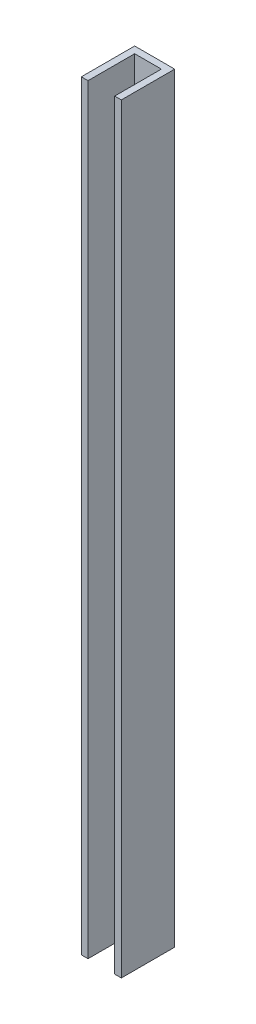
ISO-10303-21;
HEADER;
FILE_DESCRIPTION(('STEP AP214'),'2;1');
FILE_NAME('part.step','',(''),(''),'','','');
FILE_SCHEMA(('AUTOMOTIVE_DESIGN { 1 0 10303 214 1 1 1 1 }'));
ENDSEC;
DATA;
#1=APPLICATION_CONTEXT('core data for automotive mechanical design processes');
#2=APPLICATION_PROTOCOL_DEFINITION('international standard','automotive_design',2000,#1);
#3=PRODUCT_CONTEXT('',#1,'mechanical');
#4=PRODUCT('Part','Part','',(#3));
#5=PRODUCT_RELATED_PRODUCT_CATEGORY('part','',(#4));
#6=PRODUCT_DEFINITION_FORMATION('','',#4);
#7=PRODUCT_DEFINITION_CONTEXT('part definition',#1,'design');
#8=PRODUCT_DEFINITION('design','',#6,#7);
#9=PRODUCT_DEFINITION_SHAPE('','',#8);
#10=(LENGTH_UNIT() NAMED_UNIT(*) SI_UNIT(.MILLI.,.METRE.));
#11=(NAMED_UNIT(*) PLANE_ANGLE_UNIT() SI_UNIT($,.RADIAN.));
#12=(NAMED_UNIT(*) SI_UNIT($,.STERADIAN.) SOLID_ANGLE_UNIT());
#13=UNCERTAINTY_MEASURE_WITH_UNIT(LENGTH_MEASURE(1.E-05),#10,'distance_accuracy_value','');
#14=(GEOMETRIC_REPRESENTATION_CONTEXT(3) GLOBAL_UNCERTAINTY_ASSIGNED_CONTEXT((#13)) GLOBAL_UNIT_ASSIGNED_CONTEXT((#10,
#11,#12)) REPRESENTATION_CONTEXT('',''));
#15=CARTESIAN_POINT('',(0.,0.,0.));
#16=DIRECTION('',(0.,0.,1.));
#17=DIRECTION('',(1.,0.,0.));
#18=AXIS2_PLACEMENT_3D('',#15,#16,#17);
#19=CARTESIAN_POINT('',(3.175,361.95,0.));
#20=DIRECTION('',(0.,0.,-1.));
#21=DIRECTION('',(-1.,0.,0.));
#22=AXIS2_PLACEMENT_3D('',#19,#20,#21);
#23=PLANE('',#22);
#24=DIRECTION('',(1.,0.,0.));
#25=VECTOR('',#24,1.);
#26=CARTESIAN_POINT('',(3.175,0.,0.));
#27=LINE('',#26,#25);
#28=CARTESIAN_POINT('',(0.,0.,0.));
#29=VERTEX_POINT('',#28);
#30=CARTESIAN_POINT('',(3.175,0.,0.));
#31=VERTEX_POINT('',#30);
#32=EDGE_CURVE('E129',#29,#31,#27,.T.);
#33=ORIENTED_EDGE('',*,*,#32,.T.);
#34=DIRECTION('',(0.,-1.,0.));
#35=VECTOR('',#34,1.);
#36=CARTESIAN_POINT('',(3.175,361.95,0.));
#37=LINE('',#36,#35);
#38=CARTESIAN_POINT('',(3.175,361.95,0.));
#39=VERTEX_POINT('',#38);
#40=EDGE_CURVE('E11',#39,#31,#37,.T.);
#41=ORIENTED_EDGE('',*,*,#40,.F.);
#42=DIRECTION('',(1.,0.,0.));
#43=VECTOR('',#42,1.);
#44=CARTESIAN_POINT('',(3.175,361.95,0.));
#45=LINE('',#44,#43);
#46=CARTESIAN_POINT('',(0.,361.95,0.));
#47=VERTEX_POINT('',#46);
#48=EDGE_CURVE('E143',#47,#39,#45,.T.);
#49=ORIENTED_EDGE('',*,*,#48,.F.);
#50=DIRECTION('',(0.,-1.,0.));
#51=VECTOR('',#50,1.);
#52=CARTESIAN_POINT('',(0.,361.95,0.));
#53=LINE('',#52,#51);
#54=EDGE_CURVE('E125',#47,#29,#53,.T.);
#55=ORIENTED_EDGE('',*,*,#54,.T.);
#56=EDGE_LOOP('',(#33,#41,#49,#55));
#57=FACE_BOUND('',#56,.T.);
#58=ADVANCED_FACE('F33',(#57),#23,.F.);
#59=CARTESIAN_POINT('',(3.175,361.95,-22.225));
#60=DIRECTION('',(-1.,0.,0.));
#61=DIRECTION('',(0.,0.,1.));
#62=AXIS2_PLACEMENT_3D('',#59,#60,#61);
#63=PLANE('',#62);
#64=DIRECTION('',(0.,0.,-1.));
#65=VECTOR('',#64,1.);
#66=CARTESIAN_POINT('',(3.175,0.,-22.225));
#67=LINE('',#66,#65);
#68=CARTESIAN_POINT('',(3.175,0.,-22.225));
#69=VERTEX_POINT('',#68);
#70=EDGE_CURVE('E132',#31,#69,#67,.T.);
#71=ORIENTED_EDGE('',*,*,#70,.T.);
#72=DIRECTION('',(0.,-1.,0.));
#73=VECTOR('',#72,1.);
#74=CARTESIAN_POINT('',(3.175,361.95,-22.225));
#75=LINE('',#74,#73);
#76=CARTESIAN_POINT('',(3.175,361.95,-22.225));
#77=VERTEX_POINT('',#76);
#78=EDGE_CURVE('E41',#77,#69,#75,.T.);
#79=ORIENTED_EDGE('',*,*,#78,.F.);
#80=DIRECTION('',(0.,0.,-1.));
#81=VECTOR('',#80,1.);
#82=CARTESIAN_POINT('',(3.175,361.95,-22.225));
#83=LINE('',#82,#81);
#84=EDGE_CURVE('E92',#39,#77,#83,.T.);
#85=ORIENTED_EDGE('',*,*,#84,.F.);
#86=ORIENTED_EDGE('',*,*,#40,.T.);
#87=EDGE_LOOP('',(#71,#79,#85,#86));
#88=FACE_BOUND('',#87,.T.);
#89=ADVANCED_FACE('F178',(#88),#63,.F.);
#90=CARTESIAN_POINT('',(15.875,361.95,-22.225));
#91=DIRECTION('',(0.,0.,-1.));
#92=DIRECTION('',(-1.,0.,0.));
#93=AXIS2_PLACEMENT_3D('',#90,#91,#92);
#94=PLANE('',#93);
#95=DIRECTION('',(1.,0.,0.));
#96=VECTOR('',#95,1.);
#97=CARTESIAN_POINT('',(15.875,0.,-22.225));
#98=LINE('',#97,#96);
#99=CARTESIAN_POINT('',(15.875,0.,-22.225));
#100=VERTEX_POINT('',#99);
#101=EDGE_CURVE('E134',#69,#100,#98,.T.);
#102=ORIENTED_EDGE('',*,*,#101,.T.);
#103=DIRECTION('',(0.,-1.,0.));
#104=VECTOR('',#103,1.);
#105=CARTESIAN_POINT('',(15.875,361.95,-22.225));
#106=LINE('',#105,#104);
#107=CARTESIAN_POINT('',(15.875,361.95,-22.225));
#108=VERTEX_POINT('',#107);
#109=EDGE_CURVE('E150',#108,#100,#106,.T.);
#110=ORIENTED_EDGE('',*,*,#109,.F.);
#111=DIRECTION('',(1.,0.,0.));
#112=VECTOR('',#111,1.);
#113=CARTESIAN_POINT('',(15.875,361.95,-22.225));
#114=LINE('',#113,#112);
#115=EDGE_CURVE('E158',#77,#108,#114,.T.);
#116=ORIENTED_EDGE('',*,*,#115,.F.);
#117=ORIENTED_EDGE('',*,*,#78,.T.);
#118=EDGE_LOOP('',(#102,#110,#116,#117));
#119=FACE_BOUND('',#118,.T.);
#120=ADVANCED_FACE('F156',(#119),#94,.F.);
#121=CARTESIAN_POINT('',(15.875,361.95,0.));
#122=DIRECTION('',(1.,0.,0.));
#123=DIRECTION('',(0.,0.,-1.));
#124=AXIS2_PLACEMENT_3D('',#121,#122,#123);
#125=PLANE('',#124);
#126=DIRECTION('',(0.,0.,1.));
#127=VECTOR('',#126,1.);
#128=CARTESIAN_POINT('',(15.875,0.,0.));
#129=LINE('',#128,#127);
#130=CARTESIAN_POINT('',(15.875,0.,0.));
#131=VERTEX_POINT('',#130);
#132=EDGE_CURVE('E136',#100,#131,#129,.T.);
#133=ORIENTED_EDGE('',*,*,#132,.T.);
#134=DIRECTION('',(0.,-1.,0.));
#135=VECTOR('',#134,1.);
#136=CARTESIAN_POINT('',(15.875,361.95,0.));
#137=LINE('',#136,#135);
#138=CARTESIAN_POINT('',(15.875,361.95,0.));
#139=VERTEX_POINT('',#138);
#140=EDGE_CURVE('E147',#139,#131,#137,.T.);
#141=ORIENTED_EDGE('',*,*,#140,.F.);
#142=DIRECTION('',(0.,0.,1.));
#143=VECTOR('',#142,1.);
#144=CARTESIAN_POINT('',(15.875,361.95,0.));
#145=LINE('',#144,#143);
#146=EDGE_CURVE('E170',#108,#139,#145,.T.);
#147=ORIENTED_EDGE('',*,*,#146,.F.);
#148=ORIENTED_EDGE('',*,*,#109,.T.);
#149=EDGE_LOOP('',(#133,#141,#147,#148));
#150=FACE_BOUND('',#149,.T.);
#151=ADVANCED_FACE('F166',(#150),#125,.F.);
#152=CARTESIAN_POINT('',(19.05,361.95,0.));
#153=DIRECTION('',(0.,0.,-1.));
#154=DIRECTION('',(-1.,0.,0.));
#155=AXIS2_PLACEMENT_3D('',#152,#153,#154);
#156=PLANE('',#155);
#157=DIRECTION('',(1.,0.,0.));
#158=VECTOR('',#157,1.);
#159=CARTESIAN_POINT('',(19.05,0.,0.));
#160=LINE('',#159,#158);
#161=CARTESIAN_POINT('',(19.05,0.,0.));
#162=VERTEX_POINT('',#161);
#163=EDGE_CURVE('E138',#131,#162,#160,.T.);
#164=ORIENTED_EDGE('',*,*,#163,.T.);
#165=DIRECTION('',(0.,-1.,0.));
#166=VECTOR('',#165,1.);
#167=CARTESIAN_POINT('',(19.05,361.95,0.));
#168=LINE('',#167,#166);
#169=CARTESIAN_POINT('',(19.05,361.95,0.));
#170=VERTEX_POINT('',#169);
#171=EDGE_CURVE('E120',#170,#162,#168,.T.);
#172=ORIENTED_EDGE('',*,*,#171,.F.);
#173=DIRECTION('',(1.,0.,0.));
#174=VECTOR('',#173,1.);
#175=CARTESIAN_POINT('',(19.05,361.95,0.));
#176=LINE('',#175,#174);
#177=EDGE_CURVE('E111',#139,#170,#176,.T.);
#178=ORIENTED_EDGE('',*,*,#177,.F.);
#179=ORIENTED_EDGE('',*,*,#140,.T.);
#180=EDGE_LOOP('',(#164,#172,#178,#179));
#181=FACE_BOUND('',#180,.T.);
#182=ADVANCED_FACE('F169',(#181),#156,.F.);
#183=CARTESIAN_POINT('',(19.05,361.95,-25.4));
#184=DIRECTION('',(-1.,0.,0.));
#185=DIRECTION('',(0.,0.,1.));
#186=AXIS2_PLACEMENT_3D('',#183,#184,#185);
#187=PLANE('',#186);
#188=DIRECTION('',(0.,0.,-1.));
#189=VECTOR('',#188,1.);
#190=CARTESIAN_POINT('',(19.05,0.,-25.4));
#191=LINE('',#190,#189);
#192=CARTESIAN_POINT('',(19.05,0.,-25.4));
#193=VERTEX_POINT('',#192);
#194=EDGE_CURVE('E119',#162,#193,#191,.T.);
#195=ORIENTED_EDGE('',*,*,#194,.T.);
#196=DIRECTION('',(0.,-1.,0.));
#197=VECTOR('',#196,1.);
#198=CARTESIAN_POINT('',(19.05,361.95,-25.4));
#199=LINE('',#198,#197);
#200=CARTESIAN_POINT('',(19.05,361.95,-25.4));
#201=VERTEX_POINT('',#200);
#202=EDGE_CURVE('E116',#201,#193,#199,.T.);
#203=ORIENTED_EDGE('',*,*,#202,.F.);
#204=DIRECTION('',(0.,0.,-1.));
#205=VECTOR('',#204,1.);
#206=CARTESIAN_POINT('',(19.05,361.95,-25.4));
#207=LINE('',#206,#205);
#208=EDGE_CURVE('E105',#170,#201,#207,.T.);
#209=ORIENTED_EDGE('',*,*,#208,.F.);
#210=ORIENTED_EDGE('',*,*,#171,.T.);
#211=EDGE_LOOP('',(#195,#203,#209,#210));
#212=FACE_BOUND('',#211,.T.);
#213=ADVANCED_FACE('F117',(#212),#187,.F.);
#214=CARTESIAN_POINT('',(0.,361.95,-25.4));
#215=DIRECTION('',(0.,0.,1.));
#216=DIRECTION('',(1.,0.,0.));
#217=AXIS2_PLACEMENT_3D('',#214,#215,#216);
#218=PLANE('',#217);
#219=DIRECTION('',(-1.,0.,0.));
#220=VECTOR('',#219,1.);
#221=CARTESIAN_POINT('',(0.,0.,-25.4));
#222=LINE('',#221,#220);
#223=CARTESIAN_POINT('',(0.,0.,-25.4));
#224=VERTEX_POINT('',#223);
#225=EDGE_CURVE('E78',#193,#224,#222,.T.);
#226=ORIENTED_EDGE('',*,*,#225,.T.);
#227=DIRECTION('',(0.,-1.,0.));
#228=VECTOR('',#227,1.);
#229=CARTESIAN_POINT('',(0.,361.95,-25.4));
#230=LINE('',#229,#228);
#231=CARTESIAN_POINT('',(0.,361.95,-25.4));
#232=VERTEX_POINT('',#231);
#233=EDGE_CURVE('E121',#232,#224,#230,.T.);
#234=ORIENTED_EDGE('',*,*,#233,.F.);
#235=DIRECTION('',(-1.,0.,0.));
#236=VECTOR('',#235,1.);
#237=CARTESIAN_POINT('',(0.,361.95,-25.4));
#238=LINE('',#237,#236);
#239=EDGE_CURVE('E109',#201,#232,#238,.T.);
#240=ORIENTED_EDGE('',*,*,#239,.F.);
#241=ORIENTED_EDGE('',*,*,#202,.T.);
#242=EDGE_LOOP('',(#226,#234,#240,#241));
#243=FACE_BOUND('',#242,.T.);
#244=ADVANCED_FACE('F123',(#243),#218,.F.);
#245=CARTESIAN_POINT('',(0.,361.95,0.));
#246=DIRECTION('',(1.,0.,0.));
#247=DIRECTION('',(0.,0.,-1.));
#248=AXIS2_PLACEMENT_3D('',#245,#246,#247);
#249=PLANE('',#248);
#250=DIRECTION('',(0.,0.,1.));
#251=VECTOR('',#250,1.);
#252=CARTESIAN_POINT('',(0.,0.,0.));
#253=LINE('',#252,#251);
#254=EDGE_CURVE('E84',#224,#29,#253,.T.);
#255=ORIENTED_EDGE('',*,*,#254,.T.);
#256=ORIENTED_EDGE('',*,*,#54,.F.);
#257=DIRECTION('',(0.,0.,1.));
#258=VECTOR('',#257,1.);
#259=CARTESIAN_POINT('',(0.,361.95,0.));
#260=LINE('',#259,#258);
#261=EDGE_CURVE('E49',#232,#47,#260,.T.);
#262=ORIENTED_EDGE('',*,*,#261,.F.);
#263=ORIENTED_EDGE('',*,*,#233,.T.);
#264=EDGE_LOOP('',(#255,#256,#262,#263));
#265=FACE_BOUND('',#264,.T.);
#266=ADVANCED_FACE('F194',(#265),#249,.F.);
#267=CARTESIAN_POINT('',(0.,361.95,0.));
#268=DIRECTION('',(0.,-1.,0.));
#269=DIRECTION('',(0.,0.,-1.));
#270=AXIS2_PLACEMENT_3D('',#267,#268,#269);
#271=PLANE('',#270);
#272=ORIENTED_EDGE('',*,*,#48,.T.);
#273=ORIENTED_EDGE('',*,*,#84,.T.);
#274=ORIENTED_EDGE('',*,*,#115,.T.);
#275=ORIENTED_EDGE('',*,*,#146,.T.);
#276=ORIENTED_EDGE('',*,*,#177,.T.);
#277=ORIENTED_EDGE('',*,*,#208,.T.);
#278=ORIENTED_EDGE('',*,*,#239,.T.);
#279=ORIENTED_EDGE('',*,*,#261,.T.);
#280=EDGE_LOOP('',(#272,#273,#274,#275,#276,#277,#278,#279));
#281=FACE_BOUND('',#280,.T.);
#282=ADVANCED_FACE('F107',(#281),#271,.F.);
#283=CARTESIAN_POINT('',(0.,0.,0.));
#284=DIRECTION('',(0.,-1.,0.));
#285=DIRECTION('',(0.,0.,-1.));
#286=AXIS2_PLACEMENT_3D('',#283,#284,#285);
#287=PLANE('',#286);
#288=ORIENTED_EDGE('',*,*,#32,.F.);
#289=ORIENTED_EDGE('',*,*,#254,.F.);
#290=ORIENTED_EDGE('',*,*,#225,.F.);
#291=ORIENTED_EDGE('',*,*,#194,.F.);
#292=ORIENTED_EDGE('',*,*,#163,.F.);
#293=ORIENTED_EDGE('',*,*,#132,.F.);
#294=ORIENTED_EDGE('',*,*,#101,.F.);
#295=ORIENTED_EDGE('',*,*,#70,.F.);
#296=EDGE_LOOP('',(#288,#289,#290,#291,#292,#293,#294,#295));
#297=FACE_BOUND('',#296,.T.);
#298=ADVANCED_FACE('F162',(#297),#287,.T.);
#299=CLOSED_SHELL('',(#58,#89,#120,#151,#182,#213,#244,#266,#282,#298));
#300=MANIFOLD_SOLID_BREP('B2',#299);
#301=ADVANCED_BREP_SHAPE_REPRESENTATION('',(#18,#300),#14);
#302=SHAPE_DEFINITION_REPRESENTATION(#9,#301);
ENDSEC;
END-ISO-10303-21;
